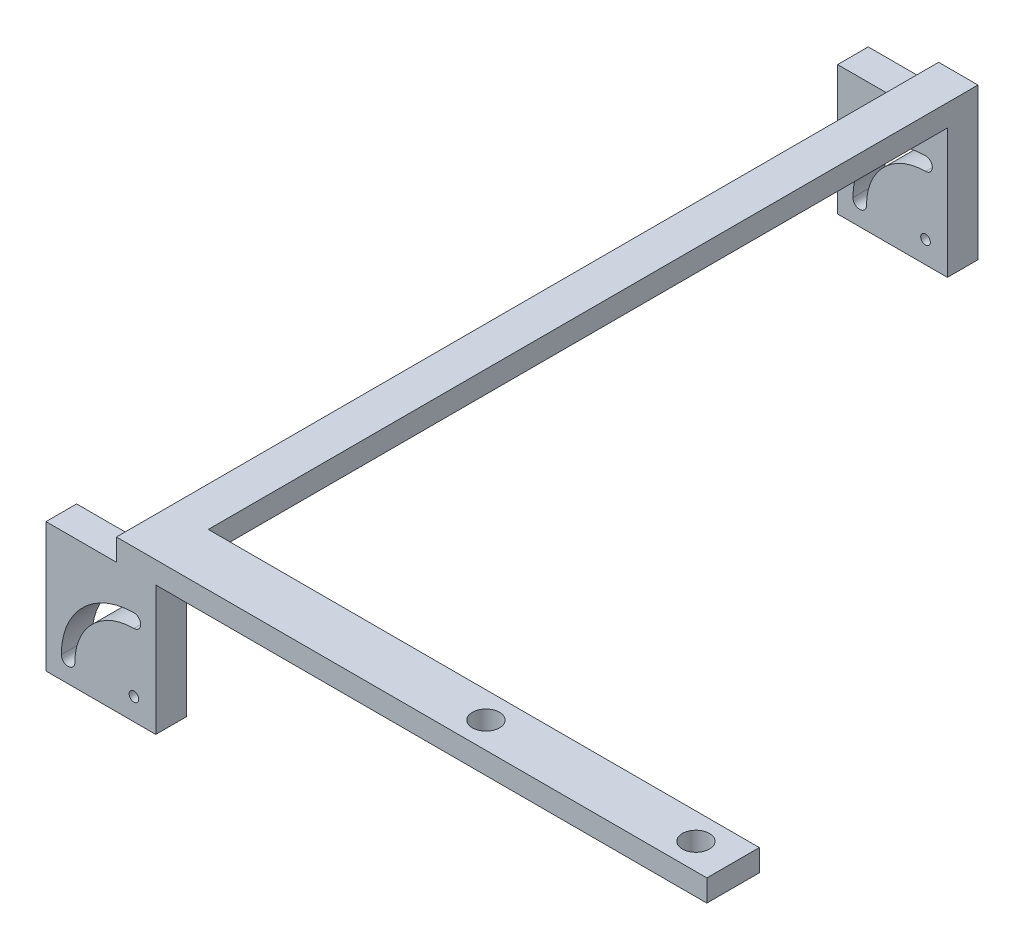
ISO-10303-21;
HEADER;
FILE_DESCRIPTION(('STEP AP214'),'2;1');
FILE_NAME('part.step','',(''),(''),'','','');
FILE_SCHEMA(('AUTOMOTIVE_DESIGN { 1 0 10303 214 1 1 1 1 }'));
ENDSEC;
DATA;
#1=APPLICATION_CONTEXT('core data for automotive mechanical design processes');
#2=APPLICATION_PROTOCOL_DEFINITION('international standard','automotive_design',2000,#1);
#3=PRODUCT_CONTEXT('',#1,'mechanical');
#4=PRODUCT('Part','Part','',(#3));
#5=PRODUCT_RELATED_PRODUCT_CATEGORY('part','',(#4));
#6=PRODUCT_DEFINITION_FORMATION('','',#4);
#7=PRODUCT_DEFINITION_CONTEXT('part definition',#1,'design');
#8=PRODUCT_DEFINITION('design','',#6,#7);
#9=PRODUCT_DEFINITION_SHAPE('','',#8);
#10=(LENGTH_UNIT() NAMED_UNIT(*) SI_UNIT(.MILLI.,.METRE.));
#11=(NAMED_UNIT(*) PLANE_ANGLE_UNIT() SI_UNIT($,.RADIAN.));
#12=(NAMED_UNIT(*) SI_UNIT($,.STERADIAN.) SOLID_ANGLE_UNIT());
#13=UNCERTAINTY_MEASURE_WITH_UNIT(LENGTH_MEASURE(1.E-05),#10,'distance_accuracy_value','');
#14=(GEOMETRIC_REPRESENTATION_CONTEXT(3) GLOBAL_UNCERTAINTY_ASSIGNED_CONTEXT((#13)) GLOBAL_UNIT_ASSIGNED_CONTEXT((#10,
#11,#12)) REPRESENTATION_CONTEXT('',''));
#15=CARTESIAN_POINT('',(0.,0.,0.));
#16=DIRECTION('',(0.,0.,1.));
#17=DIRECTION('',(1.,0.,0.));
#18=AXIS2_PLACEMENT_3D('',#15,#16,#17);
#19=CARTESIAN_POINT('',(25.1,0.,7.));
#20=DIRECTION('',(-1.,0.,0.));
#21=DIRECTION('',(0.,0.,1.));
#22=AXIS2_PLACEMENT_3D('',#19,#20,#21);
#23=PLANE('',#22);
#24=DIRECTION('',(0.,1.,0.));
#25=VECTOR('',#24,1.);
#26=CARTESIAN_POINT('',(25.1,34.6,-5.));
#27=LINE('',#26,#25);
#28=CARTESIAN_POINT('',(25.1,29.6,-5.));
#29=VERTEX_POINT('',#28);
#30=CARTESIAN_POINT('',(25.1,34.6,-5.));
#31=VERTEX_POINT('',#30);
#32=EDGE_CURVE('E206',#29,#31,#27,.T.);
#33=ORIENTED_EDGE('',*,*,#32,.F.);
#34=DIRECTION('',(0.,0.,1.));
#35=VECTOR('',#34,1.);
#36=CARTESIAN_POINT('',(25.1,29.6,-174.));
#37=LINE('',#36,#35);
#38=CARTESIAN_POINT('',(25.1,29.6,-174.));
#39=VERTEX_POINT('',#38);
#40=EDGE_CURVE('E316',#39,#29,#37,.T.);
#41=ORIENTED_EDGE('',*,*,#40,.F.);
#42=DIRECTION('',(0.,-1.,0.));
#43=VECTOR('',#42,1.);
#44=CARTESIAN_POINT('',(25.1,34.6,-174.));
#45=LINE('',#44,#43);
#46=CARTESIAN_POINT('',(25.1,0.,-174.));
#47=VERTEX_POINT('',#46);
#48=EDGE_CURVE('E283',#39,#47,#45,.T.);
#49=ORIENTED_EDGE('',*,*,#48,.T.);
#50=DIRECTION('',(0.,0.,1.));
#51=VECTOR('',#50,1.);
#52=CARTESIAN_POINT('',(25.1,0.,-181.));
#53=LINE('',#52,#51);
#54=CARTESIAN_POINT('',(25.1,0.,-181.));
#55=VERTEX_POINT('',#54);
#56=EDGE_CURVE('E305',#55,#47,#53,.T.);
#57=ORIENTED_EDGE('',*,*,#56,.F.);
#58=DIRECTION('',(0.,-1.,0.));
#59=VECTOR('',#58,1.);
#60=CARTESIAN_POINT('',(25.1,34.6,-181.));
#61=LINE('',#60,#59);
#62=CARTESIAN_POINT('',(25.1,34.6,-181.));
#63=VERTEX_POINT('',#62);
#64=EDGE_CURVE('E285',#63,#55,#61,.T.);
#65=ORIENTED_EDGE('',*,*,#64,.F.);
#66=DIRECTION('',(0.,0.,-1.));
#67=VECTOR('',#66,1.);
#68=CARTESIAN_POINT('',(25.1,34.6,7.));
#69=LINE('',#68,#67);
#70=EDGE_CURVE('E319',#31,#63,#69,.T.);
#71=ORIENTED_EDGE('',*,*,#70,.F.);
#72=EDGE_LOOP('',(#33,#41,#49,#57,#65,#71));
#73=FACE_BOUND('',#72,.T.);
#74=ADVANCED_FACE('F35',(#73),#23,.F.);
#75=DIRECTION('',(0.,0.,-1.));
#76=VECTOR('',#75,1.);
#77=CARTESIAN_POINT('',(25.1,29.6,7.));
#78=LINE('',#77,#76);
#79=CARTESIAN_POINT('',(25.1,29.6,7.));
#80=VERTEX_POINT('',#79);
#81=CARTESIAN_POINT('',(25.1,29.6,0.));
#82=VERTEX_POINT('',#81);
#83=EDGE_CURVE('E373',#80,#82,#78,.T.);
#84=ORIENTED_EDGE('',*,*,#83,.F.);
#85=DIRECTION('',(0.,1.,0.));
#86=VECTOR('',#85,1.);
#87=CARTESIAN_POINT('',(25.1,0.,7.));
#88=LINE('',#87,#86);
#89=CARTESIAN_POINT('',(25.1,0.,7.));
#90=VERTEX_POINT('',#89);
#91=EDGE_CURVE('E213',#90,#80,#88,.T.);
#92=ORIENTED_EDGE('',*,*,#91,.F.);
#93=DIRECTION('',(0.,0.,-1.));
#94=VECTOR('',#93,1.);
#95=CARTESIAN_POINT('',(25.1,0.,7.));
#96=LINE('',#95,#94);
#97=CARTESIAN_POINT('',(25.1,0.,0.));
#98=VERTEX_POINT('',#97);
#99=EDGE_CURVE('E350',#90,#98,#96,.T.);
#100=ORIENTED_EDGE('',*,*,#99,.T.);
#101=DIRECTION('',(0.,1.,0.));
#102=VECTOR('',#101,1.);
#103=CARTESIAN_POINT('',(25.1,0.,0.));
#104=LINE('',#103,#102);
#105=EDGE_CURVE('E344',#98,#82,#104,.T.);
#106=ORIENTED_EDGE('',*,*,#105,.T.);
#107=EDGE_LOOP('',(#84,#92,#100,#106));
#108=FACE_BOUND('',#107,.T.);
#109=ADVANCED_FACE('F418',(#108),#23,.F.);
#110=CARTESIAN_POINT('',(0.,0.,7.));
#111=DIRECTION('',(0.,0.,-1.));
#112=DIRECTION('',(-1.,0.,0.));
#113=AXIS2_PLACEMENT_3D('',#110,#111,#112);
#114=PLANE('',#113);
#115=CARTESIAN_POINT('',(20.1,5.,7.));
#116=DIRECTION('',(0.,0.,-1.));
#117=DIRECTION('',(-1.,0.,0.));
#118=AXIS2_PLACEMENT_3D('',#115,#116,#117);
#119=CIRCLE('',#118,13.5);
#120=CARTESIAN_POINT('',(6.6,5.,7.));
#121=VERTEX_POINT('',#120);
#122=CARTESIAN_POINT('',(20.1,18.5,7.));
#123=VERTEX_POINT('',#122);
#124=EDGE_CURVE('E223',#121,#123,#119,.T.);
#125=ORIENTED_EDGE('',*,*,#124,.F.);
#126=CARTESIAN_POINT('',(5.05,5.,7.));
#127=DIRECTION('',(0.,0.,1.));
#128=DIRECTION('',(-1.,0.,0.));
#129=AXIS2_PLACEMENT_3D('',#126,#127,#128);
#130=CIRCLE('',#129,1.55);
#131=CARTESIAN_POINT('',(3.5,5.,7.));
#132=VERTEX_POINT('',#131);
#133=EDGE_CURVE('E52',#132,#121,#130,.T.);
#134=ORIENTED_EDGE('',*,*,#133,.F.);
#135=CARTESIAN_POINT('',(20.1,5.,7.));
#136=DIRECTION('',(0.,0.,1.));
#137=DIRECTION('',(-1.,0.,0.));
#138=AXIS2_PLACEMENT_3D('',#135,#136,#137);
#139=CIRCLE('',#138,16.6);
#140=CARTESIAN_POINT('',(20.1,21.6,7.));
#141=VERTEX_POINT('',#140);
#142=EDGE_CURVE('E228',#141,#132,#139,.T.);
#143=ORIENTED_EDGE('',*,*,#142,.F.);
#144=CARTESIAN_POINT('',(20.1,20.05,7.));
#145=DIRECTION('',(0.,0.,1.));
#146=DIRECTION('',(-1.,0.,0.));
#147=AXIS2_PLACEMENT_3D('',#144,#145,#146);
#148=CIRCLE('',#147,1.55);
#149=EDGE_CURVE('E225',#123,#141,#148,.T.);
#150=ORIENTED_EDGE('',*,*,#149,.F.);
#151=EDGE_LOOP('',(#125,#134,#143,#150));
#152=FACE_BOUND('',#151,.T.);
#153=DIRECTION('',(0.,-1.,0.));
#154=VECTOR('',#153,1.);
#155=CARTESIAN_POINT('',(0.,0.,7.));
#156=LINE('',#155,#154);
#157=CARTESIAN_POINT('',(0.,29.6,7.));
#158=VERTEX_POINT('',#157);
#159=CARTESIAN_POINT('',(0.,0.,7.));
#160=VERTEX_POINT('',#159);
#161=EDGE_CURVE('E331',#158,#160,#156,.T.);
#162=ORIENTED_EDGE('',*,*,#161,.T.);
#163=DIRECTION('',(1.,0.,0.));
#164=VECTOR('',#163,1.);
#165=CARTESIAN_POINT('',(0.,0.,7.));
#166=LINE('',#165,#164);
#167=EDGE_CURVE('E333',#160,#90,#166,.T.);
#168=ORIENTED_EDGE('',*,*,#167,.T.);
#169=ORIENTED_EDGE('',*,*,#91,.T.);
#170=DIRECTION('',(-1.,0.,0.));
#171=VECTOR('',#170,1.);
#172=CARTESIAN_POINT('',(151.1,29.6,7.));
#173=LINE('',#172,#171);
#174=CARTESIAN_POINT('',(151.1,29.6,7.));
#175=VERTEX_POINT('',#174);
#176=EDGE_CURVE('E190',#175,#80,#173,.T.);
#177=ORIENTED_EDGE('',*,*,#176,.F.);
#178=DIRECTION('',(0.,-1.,0.));
#179=VECTOR('',#178,1.);
#180=CARTESIAN_POINT('',(151.1,34.6,7.));
#181=LINE('',#180,#179);
#182=CARTESIAN_POINT('',(151.1,34.6,7.));
#183=VERTEX_POINT('',#182);
#184=EDGE_CURVE('E197',#183,#175,#181,.T.);
#185=ORIENTED_EDGE('',*,*,#184,.F.);
#186=DIRECTION('',(1.,0.,0.));
#187=VECTOR('',#186,1.);
#188=CARTESIAN_POINT('',(25.1,34.6,7.));
#189=LINE('',#188,#187);
#190=CARTESIAN_POINT('',(16.1,34.6,7.));
#191=VERTEX_POINT('',#190);
#192=EDGE_CURVE('E323',#191,#183,#189,.T.);
#193=ORIENTED_EDGE('',*,*,#192,.F.);
#194=DIRECTION('',(0.,-1.,0.));
#195=VECTOR('',#194,1.);
#196=CARTESIAN_POINT('',(16.1,34.6,7.));
#197=LINE('',#196,#195);
#198=CARTESIAN_POINT('',(16.1,29.6,7.));
#199=VERTEX_POINT('',#198);
#200=EDGE_CURVE('E325',#191,#199,#197,.T.);
#201=ORIENTED_EDGE('',*,*,#200,.T.);
#202=DIRECTION('',(-1.,0.,0.));
#203=VECTOR('',#202,1.);
#204=CARTESIAN_POINT('',(0.,29.6,7.));
#205=LINE('',#204,#203);
#206=EDGE_CURVE('E337',#199,#158,#205,.T.);
#207=ORIENTED_EDGE('',*,*,#206,.T.);
#208=EDGE_LOOP('',(#162,#168,#169,#177,#185,#193,#201,#207));
#209=FACE_BOUND('',#208,.T.);
#210=CARTESIAN_POINT('',(20.1,5.,7.));
#211=DIRECTION('',(0.,0.,1.));
#212=DIRECTION('',(1.,0.,0.));
#213=AXIS2_PLACEMENT_3D('',#210,#211,#212);
#214=CIRCLE('',#213,1.1);
#215=CARTESIAN_POINT('',(21.2,5.,7.));
#216=VERTEX_POINT('',#215);
#217=EDGE_CURVE('E214',#216,#216,#214,.T.);
#218=ORIENTED_EDGE('',*,*,#217,.F.);
#219=EDGE_LOOP('',(#218));
#220=FACE_BOUND('',#219,.T.);
#221=ADVANCED_FACE('F210',(#152,#209,#220),#114,.F.);
#222=CARTESIAN_POINT('',(0.,0.,0.));
#223=DIRECTION('',(0.,0.,-1.));
#224=DIRECTION('',(-1.,0.,0.));
#225=AXIS2_PLACEMENT_3D('',#222,#223,#224);
#226=PLANE('',#225);
#227=DIRECTION('',(-1.,0.,0.));
#228=VECTOR('',#227,1.);
#229=CARTESIAN_POINT('',(25.1,29.6,0.));
#230=LINE('',#229,#228);
#231=CARTESIAN_POINT('',(16.1,29.6,0.));
#232=VERTEX_POINT('',#231);
#233=EDGE_CURVE('E308',#82,#232,#230,.T.);
#234=ORIENTED_EDGE('',*,*,#233,.F.);
#235=ORIENTED_EDGE('',*,*,#105,.F.);
#236=DIRECTION('',(1.,0.,0.));
#237=VECTOR('',#236,1.);
#238=CARTESIAN_POINT('',(0.,0.,0.));
#239=LINE('',#238,#237);
#240=CARTESIAN_POINT('',(0.,0.,0.));
#241=VERTEX_POINT('',#240);
#242=EDGE_CURVE('E342',#241,#98,#239,.T.);
#243=ORIENTED_EDGE('',*,*,#242,.F.);
#244=DIRECTION('',(0.,-1.,0.));
#245=VECTOR('',#244,1.);
#246=CARTESIAN_POINT('',(0.,0.,0.));
#247=LINE('',#246,#245);
#248=CARTESIAN_POINT('',(0.,29.6,0.));
#249=VERTEX_POINT('',#248);
#250=EDGE_CURVE('E330',#249,#241,#247,.T.);
#251=ORIENTED_EDGE('',*,*,#250,.F.);
#252=DIRECTION('',(-1.,0.,0.));
#253=VECTOR('',#252,1.);
#254=CARTESIAN_POINT('',(0.,29.6,0.));
#255=LINE('',#254,#253);
#256=EDGE_CURVE('E334',#232,#249,#255,.T.);
#257=ORIENTED_EDGE('',*,*,#256,.F.);
#258=EDGE_LOOP('',(#234,#235,#243,#251,#257));
#259=FACE_BOUND('',#258,.T.);
#260=CARTESIAN_POINT('',(5.05,5.,0.));
#261=DIRECTION('',(0.,0.,-1.));
#262=DIRECTION('',(-1.,0.,0.));
#263=AXIS2_PLACEMENT_3D('',#260,#261,#262);
#264=CIRCLE('',#263,1.55);
#265=CARTESIAN_POINT('',(6.6,5.,0.));
#266=VERTEX_POINT('',#265);
#267=CARTESIAN_POINT('',(3.5,5.,0.));
#268=VERTEX_POINT('',#267);
#269=EDGE_CURVE('E11',#266,#268,#264,.T.);
#270=ORIENTED_EDGE('',*,*,#269,.F.);
#271=CARTESIAN_POINT('',(20.1,5.,0.));
#272=DIRECTION('',(0.,0.,-1.));
#273=DIRECTION('',(-1.,0.,0.));
#274=AXIS2_PLACEMENT_3D('',#271,#272,#273);
#275=CIRCLE('',#274,13.5);
#276=CARTESIAN_POINT('',(20.1,18.5,0.));
#277=VERTEX_POINT('',#276);
#278=EDGE_CURVE('E361',#277,#266,#275,.F.);
#279=ORIENTED_EDGE('',*,*,#278,.F.);
#280=CARTESIAN_POINT('',(20.1,20.05,0.));
#281=DIRECTION('',(0.,0.,-1.));
#282=DIRECTION('',(-1.,0.,0.));
#283=AXIS2_PLACEMENT_3D('',#280,#281,#282);
#284=CIRCLE('',#283,1.55);
#285=CARTESIAN_POINT('',(20.1,21.6,0.));
#286=VERTEX_POINT('',#285);
#287=EDGE_CURVE('E363',#286,#277,#284,.T.);
#288=ORIENTED_EDGE('',*,*,#287,.F.);
#289=CARTESIAN_POINT('',(20.1,5.,0.));
#290=DIRECTION('',(0.,0.,-1.));
#291=DIRECTION('',(-1.,0.,0.));
#292=AXIS2_PLACEMENT_3D('',#289,#290,#291);
#293=CIRCLE('',#292,16.6);
#294=EDGE_CURVE('E44',#268,#286,#293,.T.);
#295=ORIENTED_EDGE('',*,*,#294,.F.);
#296=EDGE_LOOP('',(#270,#279,#288,#295));
#297=FACE_BOUND('',#296,.T.);
#298=CARTESIAN_POINT('',(20.1,5.,0.));
#299=DIRECTION('',(0.,0.,-1.));
#300=DIRECTION('',(-1.,0.,0.));
#301=AXIS2_PLACEMENT_3D('',#298,#299,#300);
#302=CIRCLE('',#301,1.1);
#303=CARTESIAN_POINT('',(19.,5.,0.));
#304=VERTEX_POINT('',#303);
#305=EDGE_CURVE('E234',#304,#304,#302,.T.);
#306=ORIENTED_EDGE('',*,*,#305,.F.);
#307=EDGE_LOOP('',(#306));
#308=FACE_BOUND('',#307,.T.);
#309=ADVANCED_FACE('F422',(#259,#297,#308),#226,.T.);
#310=CARTESIAN_POINT('',(0.,29.6,7.));
#311=DIRECTION('',(0.,-1.,0.));
#312=DIRECTION('',(0.,0.,-1.));
#313=AXIS2_PLACEMENT_3D('',#310,#311,#312);
#314=PLANE('',#313);
#315=DIRECTION('',(0.,0.,1.));
#316=VECTOR('',#315,1.);
#317=CARTESIAN_POINT('',(16.1,29.6,7.));
#318=LINE('',#317,#316);
#319=EDGE_CURVE('E318',#232,#199,#318,.T.);
#320=ORIENTED_EDGE('',*,*,#319,.F.);
#321=ORIENTED_EDGE('',*,*,#256,.T.);
#322=DIRECTION('',(0.,0.,-1.));
#323=VECTOR('',#322,1.);
#324=CARTESIAN_POINT('',(0.,29.6,7.));
#325=LINE('',#324,#323);
#326=EDGE_CURVE('E339',#158,#249,#325,.T.);
#327=ORIENTED_EDGE('',*,*,#326,.F.);
#328=ORIENTED_EDGE('',*,*,#206,.F.);
#329=EDGE_LOOP('',(#320,#321,#327,#328));
#330=FACE_BOUND('',#329,.T.);
#331=ADVANCED_FACE('F410',(#330),#314,.F.);
#332=CARTESIAN_POINT('',(0.,0.,7.));
#333=DIRECTION('',(1.,0.,0.));
#334=DIRECTION('',(0.,0.,-1.));
#335=AXIS2_PLACEMENT_3D('',#332,#333,#334);
#336=PLANE('',#335);
#337=ORIENTED_EDGE('',*,*,#250,.T.);
#338=DIRECTION('',(0.,0.,-1.));
#339=VECTOR('',#338,1.);
#340=CARTESIAN_POINT('',(0.,0.,7.));
#341=LINE('',#340,#339);
#342=EDGE_CURVE('E353',#160,#241,#341,.T.);
#343=ORIENTED_EDGE('',*,*,#342,.F.);
#344=ORIENTED_EDGE('',*,*,#161,.F.);
#345=ORIENTED_EDGE('',*,*,#326,.T.);
#346=EDGE_LOOP('',(#337,#343,#344,#345));
#347=FACE_BOUND('',#346,.T.);
#348=ADVANCED_FACE('F37',(#347),#336,.F.);
#349=CARTESIAN_POINT('',(0.,0.,7.));
#350=DIRECTION('',(0.,1.,0.));
#351=DIRECTION('',(0.,0.,1.));
#352=AXIS2_PLACEMENT_3D('',#349,#350,#351);
#353=PLANE('',#352);
#354=ORIENTED_EDGE('',*,*,#242,.T.);
#355=ORIENTED_EDGE('',*,*,#99,.F.);
#356=ORIENTED_EDGE('',*,*,#167,.F.);
#357=ORIENTED_EDGE('',*,*,#342,.T.);
#358=EDGE_LOOP('',(#354,#355,#356,#357));
#359=FACE_BOUND('',#358,.T.);
#360=ADVANCED_FACE('F414',(#359),#353,.F.);
#361=CARTESIAN_POINT('',(16.1,34.6,7.));
#362=DIRECTION('',(1.,0.,0.));
#363=DIRECTION('',(0.,0.,-1.));
#364=AXIS2_PLACEMENT_3D('',#361,#362,#363);
#365=PLANE('',#364);
#366=ORIENTED_EDGE('',*,*,#319,.T.);
#367=ORIENTED_EDGE('',*,*,#200,.F.);
#368=DIRECTION('',(0.,0.,1.));
#369=VECTOR('',#368,1.);
#370=CARTESIAN_POINT('',(16.1,34.6,7.));
#371=LINE('',#370,#369);
#372=CARTESIAN_POINT('',(16.1,34.6,-181.));
#373=VERTEX_POINT('',#372);
#374=EDGE_CURVE('E321',#373,#191,#371,.T.);
#375=ORIENTED_EDGE('',*,*,#374,.F.);
#376=DIRECTION('',(0.,-1.,0.));
#377=VECTOR('',#376,1.);
#378=CARTESIAN_POINT('',(16.1,0.,-181.));
#379=LINE('',#378,#377);
#380=CARTESIAN_POINT('',(16.1,29.6,-181.));
#381=VERTEX_POINT('',#380);
#382=EDGE_CURVE('E358',#373,#381,#379,.T.);
#383=ORIENTED_EDGE('',*,*,#382,.T.);
#384=DIRECTION('',(0.,0.,1.));
#385=VECTOR('',#384,1.);
#386=CARTESIAN_POINT('',(16.1,29.6,-189.));
#387=LINE('',#386,#385);
#388=CARTESIAN_POINT('',(16.1,29.6,-174.));
#389=VERTEX_POINT('',#388);
#390=EDGE_CURVE('E281',#381,#389,#387,.T.);
#391=ORIENTED_EDGE('',*,*,#390,.T.);
#392=DIRECTION('',(0.,0.,1.));
#393=VECTOR('',#392,1.);
#394=CARTESIAN_POINT('',(16.1,29.6,-174.));
#395=LINE('',#394,#393);
#396=EDGE_CURVE('E312',#389,#232,#395,.T.);
#397=ORIENTED_EDGE('',*,*,#396,.T.);
#398=EDGE_LOOP('',(#366,#367,#375,#383,#391,#397));
#399=FACE_BOUND('',#398,.T.);
#400=ADVANCED_FACE('F404',(#399),#365,.F.);
#401=CARTESIAN_POINT('',(0.,34.6,0.));
#402=DIRECTION('',(0.,1.,0.));
#403=DIRECTION('',(0.,0.,1.));
#404=AXIS2_PLACEMENT_3D('',#401,#402,#403);
#405=PLANE('',#404);
#406=CARTESIAN_POINT('',(142.6,34.6,1.));
#407=DIRECTION('',(0.,1.,0.));
#408=DIRECTION('',(0.,0.,1.));
#409=AXIS2_PLACEMENT_3D('',#406,#407,#408);
#410=CIRCLE('',#409,3.09999999999999);
#411=CARTESIAN_POINT('',(142.6,34.6,4.09999999999999));
#412=VERTEX_POINT('',#411);
#413=EDGE_CURVE('E369',#412,#412,#410,.T.);
#414=ORIENTED_EDGE('',*,*,#413,.F.);
#415=EDGE_LOOP('',(#414));
#416=FACE_BOUND('',#415,.T.);
#417=CARTESIAN_POINT('',(94.6,34.6,1.));
#418=DIRECTION('',(0.,1.,0.));
#419=DIRECTION('',(0.,0.,1.));
#420=AXIS2_PLACEMENT_3D('',#417,#418,#419);
#421=CIRCLE('',#420,3.1);
#422=CARTESIAN_POINT('',(94.6,34.6,4.1));
#423=VERTEX_POINT('',#422);
#424=EDGE_CURVE('E375',#423,#423,#421,.T.);
#425=ORIENTED_EDGE('',*,*,#424,.F.);
#426=EDGE_LOOP('',(#425));
#427=FACE_BOUND('',#426,.T.);
#428=DIRECTION('',(1.,0.,0.));
#429=VECTOR('',#428,1.);
#430=CARTESIAN_POINT('',(25.1,34.6,-181.));
#431=LINE('',#430,#429);
#432=EDGE_CURVE('E294',#373,#63,#431,.T.);
#433=ORIENTED_EDGE('',*,*,#432,.F.);
#434=ORIENTED_EDGE('',*,*,#374,.T.);
#435=ORIENTED_EDGE('',*,*,#192,.T.);
#436=DIRECTION('',(0.,0.,1.));
#437=VECTOR('',#436,1.);
#438=CARTESIAN_POINT('',(151.1,34.6,7.));
#439=LINE('',#438,#437);
#440=CARTESIAN_POINT('',(151.1,34.6,-5.));
#441=VERTEX_POINT('',#440);
#442=EDGE_CURVE('E203',#441,#183,#439,.T.);
#443=ORIENTED_EDGE('',*,*,#442,.F.);
#444=DIRECTION('',(-1.,0.,0.));
#445=VECTOR('',#444,1.);
#446=CARTESIAN_POINT('',(151.1,34.6,-5.));
#447=LINE('',#446,#445);
#448=EDGE_CURVE('E218',#441,#31,#447,.T.);
#449=ORIENTED_EDGE('',*,*,#448,.T.);
#450=ORIENTED_EDGE('',*,*,#70,.T.);
#451=EDGE_LOOP('',(#433,#434,#435,#443,#449,#450));
#452=FACE_BOUND('',#451,.T.);
#453=ADVANCED_FACE('F390',(#416,#427,#452),#405,.T.);
#454=CARTESIAN_POINT('',(25.1,29.6,-174.));
#455=DIRECTION('',(0.,1.,0.));
#456=DIRECTION('',(0.,0.,1.));
#457=AXIS2_PLACEMENT_3D('',#454,#455,#456);
#458=PLANE('',#457);
#459=CARTESIAN_POINT('',(142.6,29.6,1.));
#460=DIRECTION('',(0.,1.,0.));
#461=DIRECTION('',(0.,0.,1.));
#462=AXIS2_PLACEMENT_3D('',#459,#460,#461);
#463=CIRCLE('',#462,3.09999999999999);
#464=CARTESIAN_POINT('',(142.6,29.6,4.09999999999999));
#465=VERTEX_POINT('',#464);
#466=EDGE_CURVE('E39',#465,#465,#463,.T.);
#467=ORIENTED_EDGE('',*,*,#466,.T.);
#468=EDGE_LOOP('',(#467));
#469=FACE_BOUND('',#468,.T.);
#470=CARTESIAN_POINT('',(94.6,29.6,1.));
#471=DIRECTION('',(0.,1.,0.));
#472=DIRECTION('',(0.,0.,1.));
#473=AXIS2_PLACEMENT_3D('',#470,#471,#472);
#474=CIRCLE('',#473,3.1);
#475=CARTESIAN_POINT('',(94.6,29.6,4.1));
#476=VERTEX_POINT('',#475);
#477=EDGE_CURVE('E367',#476,#476,#474,.T.);
#478=ORIENTED_EDGE('',*,*,#477,.T.);
#479=EDGE_LOOP('',(#478));
#480=FACE_BOUND('',#479,.T.);
#481=ORIENTED_EDGE('',*,*,#233,.T.);
#482=ORIENTED_EDGE('',*,*,#396,.F.);
#483=DIRECTION('',(-1.,0.,0.));
#484=VECTOR('',#483,1.);
#485=CARTESIAN_POINT('',(25.1,29.6,-174.));
#486=LINE('',#485,#484);
#487=EDGE_CURVE('E309',#39,#389,#486,.T.);
#488=ORIENTED_EDGE('',*,*,#487,.F.);
#489=ORIENTED_EDGE('',*,*,#40,.T.);
#490=DIRECTION('',(-1.,0.,0.));
#491=VECTOR('',#490,1.);
#492=CARTESIAN_POINT('',(151.1,29.6,-5.));
#493=LINE('',#492,#491);
#494=CARTESIAN_POINT('',(151.1,29.6,-5.));
#495=VERTEX_POINT('',#494);
#496=EDGE_CURVE('E193',#495,#29,#493,.T.);
#497=ORIENTED_EDGE('',*,*,#496,.F.);
#498=DIRECTION('',(0.,0.,-1.));
#499=VECTOR('',#498,1.);
#500=CARTESIAN_POINT('',(151.1,29.6,7.));
#501=LINE('',#500,#499);
#502=EDGE_CURVE('E185',#175,#495,#501,.T.);
#503=ORIENTED_EDGE('',*,*,#502,.F.);
#504=ORIENTED_EDGE('',*,*,#176,.T.);
#505=ORIENTED_EDGE('',*,*,#83,.T.);
#506=EDGE_LOOP('',(#481,#482,#488,#489,#497,#503,#504,#505));
#507=FACE_BOUND('',#506,.T.);
#508=ADVANCED_FACE('F188',(#469,#480,#507),#458,.F.);
#509=CARTESIAN_POINT('',(0.,0.,-174.));
#510=DIRECTION('',(0.,0.,-1.));
#511=DIRECTION('',(-1.,0.,0.));
#512=AXIS2_PLACEMENT_3D('',#509,#510,#511);
#513=PLANE('',#512);
#514=CARTESIAN_POINT('',(20.1,5.,-174.));
#515=DIRECTION('',(0.,0.,-1.));
#516=DIRECTION('',(-1.,0.,0.));
#517=AXIS2_PLACEMENT_3D('',#514,#515,#516);
#518=CIRCLE('',#517,1.1);
#519=CARTESIAN_POINT('',(19.,5.,-174.));
#520=VERTEX_POINT('',#519);
#521=EDGE_CURVE('E274',#520,#520,#518,.T.);
#522=ORIENTED_EDGE('',*,*,#521,.T.);
#523=EDGE_LOOP('',(#522));
#524=FACE_BOUND('',#523,.T.);
#525=CARTESIAN_POINT('',(20.1,5.,-174.));
#526=DIRECTION('',(0.,0.,-1.));
#527=DIRECTION('',(-1.,0.,0.));
#528=AXIS2_PLACEMENT_3D('',#525,#526,#527);
#529=CIRCLE('',#528,13.5);
#530=CARTESIAN_POINT('',(20.1,18.5,-174.));
#531=VERTEX_POINT('',#530);
#532=CARTESIAN_POINT('',(6.6,5.,-174.));
#533=VERTEX_POINT('',#532);
#534=EDGE_CURVE('E268',#531,#533,#529,.F.);
#535=ORIENTED_EDGE('',*,*,#534,.T.);
#536=CARTESIAN_POINT('',(5.05,5.,-174.));
#537=DIRECTION('',(0.,0.,-1.));
#538=DIRECTION('',(-1.,0.,0.));
#539=AXIS2_PLACEMENT_3D('',#536,#537,#538);
#540=CIRCLE('',#539,1.55);
#541=CARTESIAN_POINT('',(3.5,5.,-174.));
#542=VERTEX_POINT('',#541);
#543=EDGE_CURVE('E271',#533,#542,#540,.T.);
#544=ORIENTED_EDGE('',*,*,#543,.T.);
#545=CARTESIAN_POINT('',(20.1,5.,-174.));
#546=DIRECTION('',(0.,0.,-1.));
#547=DIRECTION('',(-1.,0.,0.));
#548=AXIS2_PLACEMENT_3D('',#545,#546,#547);
#549=CIRCLE('',#548,16.6);
#550=CARTESIAN_POINT('',(20.1,21.6,-174.));
#551=VERTEX_POINT('',#550);
#552=EDGE_CURVE('E256',#542,#551,#549,.T.);
#553=ORIENTED_EDGE('',*,*,#552,.T.);
#554=CARTESIAN_POINT('',(20.1,20.05,-174.));
#555=DIRECTION('',(0.,0.,-1.));
#556=DIRECTION('',(-1.,0.,0.));
#557=AXIS2_PLACEMENT_3D('',#554,#555,#556);
#558=CIRCLE('',#557,1.55);
#559=EDGE_CURVE('E265',#551,#531,#558,.T.);
#560=ORIENTED_EDGE('',*,*,#559,.T.);
#561=EDGE_LOOP('',(#535,#544,#553,#560));
#562=FACE_BOUND('',#561,.T.);
#563=ORIENTED_EDGE('',*,*,#487,.T.);
#564=DIRECTION('',(1.,0.,0.));
#565=VECTOR('',#564,1.);
#566=CARTESIAN_POINT('',(0.,29.6,-174.));
#567=LINE('',#566,#565);
#568=CARTESIAN_POINT('',(0.,29.6,-174.));
#569=VERTEX_POINT('',#568);
#570=EDGE_CURVE('E277',#569,#389,#567,.T.);
#571=ORIENTED_EDGE('',*,*,#570,.F.);
#572=DIRECTION('',(0.,1.,0.));
#573=VECTOR('',#572,1.);
#574=CARTESIAN_POINT('',(0.,34.6,-174.));
#575=LINE('',#574,#573);
#576=CARTESIAN_POINT('',(0.,0.,-174.));
#577=VERTEX_POINT('',#576);
#578=EDGE_CURVE('E289',#577,#569,#575,.T.);
#579=ORIENTED_EDGE('',*,*,#578,.F.);
#580=DIRECTION('',(-1.,0.,0.));
#581=VECTOR('',#580,1.);
#582=CARTESIAN_POINT('',(25.1,0.,-174.));
#583=LINE('',#582,#581);
#584=EDGE_CURVE('E299',#47,#577,#583,.T.);
#585=ORIENTED_EDGE('',*,*,#584,.F.);
#586=ORIENTED_EDGE('',*,*,#48,.F.);
#587=EDGE_LOOP('',(#563,#571,#579,#585,#586));
#588=FACE_BOUND('',#587,.T.);
#589=ADVANCED_FACE('F510',(#524,#562,#588),#513,.F.);
#590=CARTESIAN_POINT('',(25.1,0.,-181.));
#591=DIRECTION('',(0.,1.,0.));
#592=DIRECTION('',(0.,0.,1.));
#593=AXIS2_PLACEMENT_3D('',#590,#591,#592);
#594=PLANE('',#593);
#595=ORIENTED_EDGE('',*,*,#584,.T.);
#596=DIRECTION('',(0.,0.,1.));
#597=VECTOR('',#596,1.);
#598=CARTESIAN_POINT('',(0.,0.,-181.));
#599=LINE('',#598,#597);
#600=CARTESIAN_POINT('',(0.,0.,-181.));
#601=VERTEX_POINT('',#600);
#602=EDGE_CURVE('E297',#601,#577,#599,.T.);
#603=ORIENTED_EDGE('',*,*,#602,.F.);
#604=DIRECTION('',(-1.,0.,0.));
#605=VECTOR('',#604,1.);
#606=CARTESIAN_POINT('',(25.1,0.,-181.));
#607=LINE('',#606,#605);
#608=EDGE_CURVE('E288',#55,#601,#607,.T.);
#609=ORIENTED_EDGE('',*,*,#608,.F.);
#610=ORIENTED_EDGE('',*,*,#56,.T.);
#611=EDGE_LOOP('',(#595,#603,#609,#610));
#612=FACE_BOUND('',#611,.T.);
#613=ADVANCED_FACE('F577',(#612),#594,.F.);
#614=CARTESIAN_POINT('',(0.,34.6,-181.));
#615=DIRECTION('',(1.,0.,0.));
#616=DIRECTION('',(0.,0.,-1.));
#617=AXIS2_PLACEMENT_3D('',#614,#615,#616);
#618=PLANE('',#617);
#619=ORIENTED_EDGE('',*,*,#578,.T.);
#620=DIRECTION('',(0.,0.,1.));
#621=VECTOR('',#620,1.);
#622=CARTESIAN_POINT('',(0.,29.6,-189.));
#623=LINE('',#622,#621);
#624=CARTESIAN_POINT('',(0.,29.6,-181.));
#625=VERTEX_POINT('',#624);
#626=EDGE_CURVE('E280',#625,#569,#623,.T.);
#627=ORIENTED_EDGE('',*,*,#626,.F.);
#628=DIRECTION('',(0.,1.,0.));
#629=VECTOR('',#628,1.);
#630=CARTESIAN_POINT('',(0.,34.6,-181.));
#631=LINE('',#630,#629);
#632=EDGE_CURVE('E291',#601,#625,#631,.T.);
#633=ORIENTED_EDGE('',*,*,#632,.F.);
#634=ORIENTED_EDGE('',*,*,#602,.T.);
#635=EDGE_LOOP('',(#619,#627,#633,#634));
#636=FACE_BOUND('',#635,.T.);
#637=ADVANCED_FACE('F574',(#636),#618,.F.);
#638=CARTESIAN_POINT('',(0.,0.,-181.));
#639=DIRECTION('',(0.,0.,-1.));
#640=DIRECTION('',(-1.,0.,0.));
#641=AXIS2_PLACEMENT_3D('',#638,#639,#640);
#642=PLANE('',#641);
#643=CARTESIAN_POINT('',(20.1,5.,-181.));
#644=DIRECTION('',(0.,0.,-1.));
#645=DIRECTION('',(-1.,0.,0.));
#646=AXIS2_PLACEMENT_3D('',#643,#644,#645);
#647=CIRCLE('',#646,1.1);
#648=CARTESIAN_POINT('',(19.,5.,-181.));
#649=VERTEX_POINT('',#648);
#650=EDGE_CURVE('E239',#649,#649,#647,.T.);
#651=ORIENTED_EDGE('',*,*,#650,.F.);
#652=EDGE_LOOP('',(#651));
#653=FACE_BOUND('',#652,.T.);
#654=CARTESIAN_POINT('',(5.05,5.,-181.));
#655=DIRECTION('',(0.,0.,-1.));
#656=DIRECTION('',(1.,0.,0.));
#657=AXIS2_PLACEMENT_3D('',#654,#655,#656);
#658=CIRCLE('',#657,1.55);
#659=CARTESIAN_POINT('',(6.6,5.,-181.));
#660=VERTEX_POINT('',#659);
#661=CARTESIAN_POINT('',(3.5,5.,-181.));
#662=VERTEX_POINT('',#661);
#663=EDGE_CURVE('E242',#660,#662,#658,.T.);
#664=ORIENTED_EDGE('',*,*,#663,.F.);
#665=CARTESIAN_POINT('',(20.1,5.,-181.));
#666=DIRECTION('',(0.,0.,1.));
#667=DIRECTION('',(-1.,0.,0.));
#668=AXIS2_PLACEMENT_3D('',#665,#666,#667);
#669=CIRCLE('',#668,13.5);
#670=CARTESIAN_POINT('',(20.1,18.5,-181.));
#671=VERTEX_POINT('',#670);
#672=EDGE_CURVE('E250',#671,#660,#669,.T.);
#673=ORIENTED_EDGE('',*,*,#672,.F.);
#674=CARTESIAN_POINT('',(20.1,20.05,-181.));
#675=DIRECTION('',(0.,0.,-1.));
#676=DIRECTION('',(-1.,0.,0.));
#677=AXIS2_PLACEMENT_3D('',#674,#675,#676);
#678=CIRCLE('',#677,1.55);
#679=CARTESIAN_POINT('',(20.1,21.6,-181.));
#680=VERTEX_POINT('',#679);
#681=EDGE_CURVE('E247',#680,#671,#678,.T.);
#682=ORIENTED_EDGE('',*,*,#681,.F.);
#683=CARTESIAN_POINT('',(20.1,5.,-181.));
#684=DIRECTION('',(0.,0.,-1.));
#685=DIRECTION('',(-1.,0.,0.));
#686=AXIS2_PLACEMENT_3D('',#683,#684,#685);
#687=CIRCLE('',#686,16.6);
#688=EDGE_CURVE('E244',#662,#680,#687,.T.);
#689=ORIENTED_EDGE('',*,*,#688,.F.);
#690=EDGE_LOOP('',(#664,#673,#682,#689));
#691=FACE_BOUND('',#690,.T.);
#692=ORIENTED_EDGE('',*,*,#382,.F.);
#693=ORIENTED_EDGE('',*,*,#432,.T.);
#694=ORIENTED_EDGE('',*,*,#64,.T.);
#695=ORIENTED_EDGE('',*,*,#608,.T.);
#696=ORIENTED_EDGE('',*,*,#632,.T.);
#697=DIRECTION('',(-1.,0.,0.));
#698=VECTOR('',#697,1.);
#699=CARTESIAN_POINT('',(0.,29.6,-181.));
#700=LINE('',#699,#698);
#701=EDGE_CURVE('E356',#381,#625,#700,.T.);
#702=ORIENTED_EDGE('',*,*,#701,.F.);
#703=EDGE_LOOP('',(#692,#693,#694,#695,#696,#702));
#704=FACE_BOUND('',#703,.T.);
#705=ADVANCED_FACE('F399',(#653,#691,#704),#642,.T.);
#706=CARTESIAN_POINT('',(0.,29.6,-189.));
#707=DIRECTION('',(0.,-1.,0.));
#708=DIRECTION('',(0.,0.,-1.));
#709=AXIS2_PLACEMENT_3D('',#706,#707,#708);
#710=PLANE('',#709);
#711=ORIENTED_EDGE('',*,*,#701,.T.);
#712=ORIENTED_EDGE('',*,*,#626,.T.);
#713=ORIENTED_EDGE('',*,*,#570,.T.);
#714=ORIENTED_EDGE('',*,*,#390,.F.);
#715=EDGE_LOOP('',(#711,#712,#713,#714));
#716=FACE_BOUND('',#715,.T.);
#717=ADVANCED_FACE('F567',(#716),#710,.F.);
#718=CARTESIAN_POINT('',(5.05,5.,-152.));
#719=DIRECTION('',(0.,0.,-1.));
#720=DIRECTION('',(-1.,0.,0.));
#721=AXIS2_PLACEMENT_3D('',#718,#719,#720);
#722=CYLINDRICAL_SURFACE('',#721,1.55);
#723=DIRECTION('',(0.,0.,-1.));
#724=VECTOR('',#723,1.);
#725=CARTESIAN_POINT('',(6.6,5.,-152.));
#726=LINE('',#725,#724);
#727=EDGE_CURVE('E254',#533,#660,#726,.T.);
#728=ORIENTED_EDGE('',*,*,#727,.T.);
#729=ORIENTED_EDGE('',*,*,#663,.T.);
#730=DIRECTION('',(0.,0.,-1.));
#731=VECTOR('',#730,1.);
#732=CARTESIAN_POINT('',(3.5,5.,-152.));
#733=LINE('',#732,#731);
#734=EDGE_CURVE('E253',#542,#662,#733,.T.);
#735=ORIENTED_EDGE('',*,*,#734,.F.);
#736=ORIENTED_EDGE('',*,*,#543,.F.);
#737=EDGE_LOOP('',(#728,#729,#735,#736));
#738=FACE_BOUND('',#737,.T.);
#739=ADVANCED_FACE('F557',(#738),#722,.F.);
#740=CARTESIAN_POINT('',(20.1,5.,-152.));
#741=DIRECTION('',(0.,0.,-1.));
#742=DIRECTION('',(-1.,0.,0.));
#743=AXIS2_PLACEMENT_3D('',#740,#741,#742);
#744=CYLINDRICAL_SURFACE('',#743,13.5);
#745=DIRECTION('',(0.,0.,-1.));
#746=VECTOR('',#745,1.);
#747=CARTESIAN_POINT('',(20.1,18.5,-152.));
#748=LINE('',#747,#746);
#749=EDGE_CURVE('E257',#531,#671,#748,.T.);
#750=ORIENTED_EDGE('',*,*,#749,.T.);
#751=ORIENTED_EDGE('',*,*,#672,.T.);
#752=ORIENTED_EDGE('',*,*,#727,.F.);
#753=ORIENTED_EDGE('',*,*,#534,.F.);
#754=EDGE_LOOP('',(#750,#751,#752,#753));
#755=FACE_BOUND('',#754,.T.);
#756=ADVANCED_FACE('F553',(#755),#744,.T.);
#757=CARTESIAN_POINT('',(20.1,20.05,-152.));
#758=DIRECTION('',(0.,0.,-1.));
#759=DIRECTION('',(-1.,0.,0.));
#760=AXIS2_PLACEMENT_3D('',#757,#758,#759);
#761=CYLINDRICAL_SURFACE('',#760,1.55);
#762=DIRECTION('',(0.,0.,-1.));
#763=VECTOR('',#762,1.);
#764=CARTESIAN_POINT('',(20.1,21.6,-152.));
#765=LINE('',#764,#763);
#766=EDGE_CURVE('E259',#551,#680,#765,.T.);
#767=ORIENTED_EDGE('',*,*,#766,.T.);
#768=ORIENTED_EDGE('',*,*,#681,.T.);
#769=ORIENTED_EDGE('',*,*,#749,.F.);
#770=ORIENTED_EDGE('',*,*,#559,.F.);
#771=EDGE_LOOP('',(#767,#768,#769,#770));
#772=FACE_BOUND('',#771,.T.);
#773=ADVANCED_FACE('F556',(#772),#761,.F.);
#774=CARTESIAN_POINT('',(20.1,5.,-152.));
#775=DIRECTION('',(0.,0.,-1.));
#776=DIRECTION('',(-1.,0.,0.));
#777=AXIS2_PLACEMENT_3D('',#774,#775,#776);
#778=CYLINDRICAL_SURFACE('',#777,16.6);
#779=ORIENTED_EDGE('',*,*,#734,.T.);
#780=ORIENTED_EDGE('',*,*,#688,.T.);
#781=ORIENTED_EDGE('',*,*,#766,.F.);
#782=ORIENTED_EDGE('',*,*,#552,.F.);
#783=EDGE_LOOP('',(#779,#780,#781,#782));
#784=FACE_BOUND('',#783,.T.);
#785=ADVANCED_FACE('F551',(#784),#778,.F.);
#786=CARTESIAN_POINT('',(20.1,5.,-152.));
#787=DIRECTION('',(0.,0.,-1.));
#788=DIRECTION('',(-1.,0.,0.));
#789=AXIS2_PLACEMENT_3D('',#786,#787,#788);
#790=CYLINDRICAL_SURFACE('',#789,1.1);
#791=ORIENTED_EDGE('',*,*,#650,.T.);
#792=EDGE_LOOP('',(#791));
#793=FACE_BOUND('',#792,.T.);
#794=ORIENTED_EDGE('',*,*,#521,.F.);
#795=EDGE_LOOP('',(#794));
#796=FACE_BOUND('',#795,.T.);
#797=ADVANCED_FACE('F548',(#793,#796),#790,.F.);
#798=CARTESIAN_POINT('',(5.05,5.,-14.));
#799=DIRECTION('',(0.,0.,1.));
#800=DIRECTION('',(1.,0.,0.));
#801=AXIS2_PLACEMENT_3D('',#798,#799,#800);
#802=CYLINDRICAL_SURFACE('',#801,1.55);
#803=ORIENTED_EDGE('',*,*,#269,.T.);
#804=DIRECTION('',(0.,0.,1.));
#805=VECTOR('',#804,1.);
#806=CARTESIAN_POINT('',(3.5,5.,-14.));
#807=LINE('',#806,#805);
#808=EDGE_CURVE('E232',#268,#132,#807,.T.);
#809=ORIENTED_EDGE('',*,*,#808,.T.);
#810=ORIENTED_EDGE('',*,*,#133,.T.);
#811=DIRECTION('',(0.,0.,1.));
#812=VECTOR('',#811,1.);
#813=CARTESIAN_POINT('',(6.6,5.,-14.));
#814=LINE('',#813,#812);
#815=EDGE_CURVE('E231',#266,#121,#814,.T.);
#816=ORIENTED_EDGE('',*,*,#815,.F.);
#817=EDGE_LOOP('',(#803,#809,#810,#816));
#818=FACE_BOUND('',#817,.T.);
#819=ADVANCED_FACE('F539',(#818),#802,.F.);
#820=CARTESIAN_POINT('',(20.1,5.,-14.));
#821=DIRECTION('',(0.,0.,1.));
#822=DIRECTION('',(1.,0.,0.));
#823=AXIS2_PLACEMENT_3D('',#820,#821,#822);
#824=CYLINDRICAL_SURFACE('',#823,16.6);
#825=ORIENTED_EDGE('',*,*,#294,.T.);
#826=DIRECTION('',(0.,0.,1.));
#827=VECTOR('',#826,1.);
#828=CARTESIAN_POINT('',(20.1,21.6,-14.));
#829=LINE('',#828,#827);
#830=EDGE_CURVE('E235',#286,#141,#829,.T.);
#831=ORIENTED_EDGE('',*,*,#830,.T.);
#832=ORIENTED_EDGE('',*,*,#142,.T.);
#833=ORIENTED_EDGE('',*,*,#808,.F.);
#834=EDGE_LOOP('',(#825,#831,#832,#833));
#835=FACE_BOUND('',#834,.T.);
#836=ADVANCED_FACE('F535',(#835),#824,.F.);
#837=CARTESIAN_POINT('',(20.1,20.05,-14.));
#838=DIRECTION('',(0.,0.,1.));
#839=DIRECTION('',(1.,0.,0.));
#840=AXIS2_PLACEMENT_3D('',#837,#838,#839);
#841=CYLINDRICAL_SURFACE('',#840,1.55);
#842=ORIENTED_EDGE('',*,*,#287,.T.);
#843=DIRECTION('',(0.,0.,1.));
#844=VECTOR('',#843,1.);
#845=CARTESIAN_POINT('',(20.1,18.5,-14.));
#846=LINE('',#845,#844);
#847=EDGE_CURVE('E60',#277,#123,#846,.T.);
#848=ORIENTED_EDGE('',*,*,#847,.T.);
#849=ORIENTED_EDGE('',*,*,#149,.T.);
#850=ORIENTED_EDGE('',*,*,#830,.F.);
#851=EDGE_LOOP('',(#842,#848,#849,#850));
#852=FACE_BOUND('',#851,.T.);
#853=ADVANCED_FACE('F538',(#852),#841,.F.);
#854=CARTESIAN_POINT('',(20.1,5.,-14.));
#855=DIRECTION('',(0.,0.,1.));
#856=DIRECTION('',(1.,0.,0.));
#857=AXIS2_PLACEMENT_3D('',#854,#855,#856);
#858=CYLINDRICAL_SURFACE('',#857,13.5);
#859=ORIENTED_EDGE('',*,*,#278,.T.);
#860=ORIENTED_EDGE('',*,*,#815,.T.);
#861=ORIENTED_EDGE('',*,*,#124,.T.);
#862=ORIENTED_EDGE('',*,*,#847,.F.);
#863=EDGE_LOOP('',(#859,#860,#861,#862));
#864=FACE_BOUND('',#863,.T.);
#865=ADVANCED_FACE('F436',(#864),#858,.T.);
#866=CARTESIAN_POINT('',(20.1,5.,-14.));
#867=DIRECTION('',(0.,0.,1.));
#868=DIRECTION('',(1.,0.,0.));
#869=AXIS2_PLACEMENT_3D('',#866,#867,#868);
#870=CYLINDRICAL_SURFACE('',#869,1.1);
#871=ORIENTED_EDGE('',*,*,#305,.T.);
#872=EDGE_LOOP('',(#871));
#873=FACE_BOUND('',#872,.T.);
#874=ORIENTED_EDGE('',*,*,#217,.T.);
#875=EDGE_LOOP('',(#874));
#876=FACE_BOUND('',#875,.T.);
#877=ADVANCED_FACE('F432',(#873,#876),#870,.F.);
#878=CARTESIAN_POINT('',(151.1,34.6,-5.));
#879=DIRECTION('',(0.,0.,1.));
#880=DIRECTION('',(0.,-1.,0.));
#881=AXIS2_PLACEMENT_3D('',#878,#879,#880);
#882=PLANE('',#881);
#883=ORIENTED_EDGE('',*,*,#32,.T.);
#884=ORIENTED_EDGE('',*,*,#448,.F.);
#885=DIRECTION('',(0.,1.,0.));
#886=VECTOR('',#885,1.);
#887=CARTESIAN_POINT('',(151.1,34.6,-5.));
#888=LINE('',#887,#886);
#889=EDGE_CURVE('E196',#495,#441,#888,.T.);
#890=ORIENTED_EDGE('',*,*,#889,.F.);
#891=ORIENTED_EDGE('',*,*,#496,.T.);
#892=EDGE_LOOP('',(#883,#884,#890,#891));
#893=FACE_BOUND('',#892,.T.);
#894=ADVANCED_FACE('F435',(#893),#882,.F.);
#895=CARTESIAN_POINT('',(151.1,0.,0.));
#896=DIRECTION('',(1.,0.,0.));
#897=DIRECTION('',(0.,0.,-1.));
#898=AXIS2_PLACEMENT_3D('',#895,#896,#897);
#899=PLANE('',#898);
#900=ORIENTED_EDGE('',*,*,#184,.T.);
#901=ORIENTED_EDGE('',*,*,#502,.T.);
#902=ORIENTED_EDGE('',*,*,#889,.T.);
#903=ORIENTED_EDGE('',*,*,#442,.T.);
#904=EDGE_LOOP('',(#900,#901,#902,#903));
#905=FACE_BOUND('',#904,.T.);
#906=ADVANCED_FACE('F201',(#905),#899,.T.);
#907=CARTESIAN_POINT('',(94.6,-91.4,1.));
#908=DIRECTION('',(0.,1.,0.));
#909=DIRECTION('',(0.,0.,1.));
#910=AXIS2_PLACEMENT_3D('',#907,#908,#909);
#911=CYLINDRICAL_SURFACE('',#910,3.1);
#912=ORIENTED_EDGE('',*,*,#424,.T.);
#913=EDGE_LOOP('',(#912));
#914=FACE_BOUND('',#913,.T.);
#915=ORIENTED_EDGE('',*,*,#477,.F.);
#916=EDGE_LOOP('',(#915));
#917=FACE_BOUND('',#916,.T.);
#918=ADVANCED_FACE('F490',(#914,#917),#911,.F.);
#919=CARTESIAN_POINT('',(142.6,-91.4,1.));
#920=DIRECTION('',(0.,1.,0.));
#921=DIRECTION('',(0.,0.,1.));
#922=AXIS2_PLACEMENT_3D('',#919,#920,#921);
#923=CYLINDRICAL_SURFACE('',#922,3.09999999999999);
#924=ORIENTED_EDGE('',*,*,#413,.T.);
#925=EDGE_LOOP('',(#924));
#926=FACE_BOUND('',#925,.T.);
#927=ORIENTED_EDGE('',*,*,#466,.F.);
#928=EDGE_LOOP('',(#927));
#929=FACE_BOUND('',#928,.T.);
#930=ADVANCED_FACE('F520',(#926,#929),#923,.F.);
#931=CLOSED_SHELL('',(#74,#109,#221,#309,#331,#348,#360,#400,#453,#508,#589,#613,#637,#705,#717,
#739,#756,#773,#785,#797,#819,#836,#853,#865,#877,#894,#906,#918,#930));
#932=MANIFOLD_SOLID_BREP('B2',#931);
#933=ADVANCED_BREP_SHAPE_REPRESENTATION('',(#18,#932),#14);
#934=SHAPE_DEFINITION_REPRESENTATION(#9,#933);
ENDSEC;
END-ISO-10303-21;
